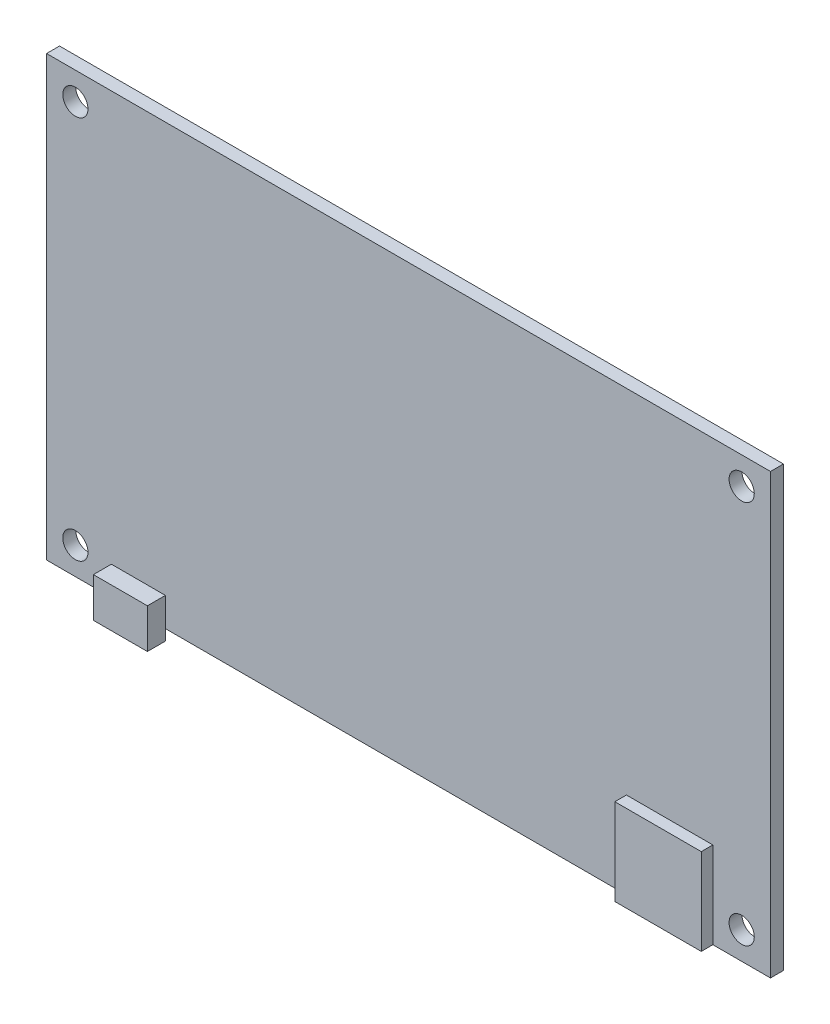
ISO-10303-21;
HEADER;
FILE_DESCRIPTION(('STEP AP214'),'2;1');
FILE_NAME('part.step','',(''),(''),'','','');
FILE_SCHEMA(('AUTOMOTIVE_DESIGN { 1 0 10303 214 1 1 1 1 }'));
ENDSEC;
DATA;
#1=APPLICATION_CONTEXT('core data for automotive mechanical design processes');
#2=APPLICATION_PROTOCOL_DEFINITION('international standard','automotive_design',2000,#1);
#3=PRODUCT_CONTEXT('',#1,'mechanical');
#4=PRODUCT('Part','Part','',(#3));
#5=PRODUCT_RELATED_PRODUCT_CATEGORY('part','',(#4));
#6=PRODUCT_DEFINITION_FORMATION('','',#4);
#7=PRODUCT_DEFINITION_CONTEXT('part definition',#1,'design');
#8=PRODUCT_DEFINITION('design','',#6,#7);
#9=PRODUCT_DEFINITION_SHAPE('','',#8);
#10=(LENGTH_UNIT() NAMED_UNIT(*) SI_UNIT(.MILLI.,.METRE.));
#11=(NAMED_UNIT(*) PLANE_ANGLE_UNIT() SI_UNIT($,.RADIAN.));
#12=(NAMED_UNIT(*) SI_UNIT($,.STERADIAN.) SOLID_ANGLE_UNIT());
#13=UNCERTAINTY_MEASURE_WITH_UNIT(LENGTH_MEASURE(1.E-05),#10,'distance_accuracy_value','');
#14=(GEOMETRIC_REPRESENTATION_CONTEXT(3) GLOBAL_UNCERTAINTY_ASSIGNED_CONTEXT((#13)) GLOBAL_UNIT_ASSIGNED_CONTEXT((#10,
#11,#12)) REPRESENTATION_CONTEXT('',''));
#15=CARTESIAN_POINT('',(0.,0.,0.));
#16=DIRECTION('',(0.,0.,1.));
#17=DIRECTION('',(1.,0.,0.));
#18=AXIS2_PLACEMENT_3D('',#15,#16,#17);
#19=CARTESIAN_POINT('',(-50.25,0.,1.8));
#20=DIRECTION('',(0.,0.,1.));
#21=DIRECTION('',(1.,0.,0.));
#22=AXIS2_PLACEMENT_3D('',#19,#20,#21);
#23=PLANE('',#22);
#24=CARTESIAN_POINT('',(46.25,57.1,1.8));
#25=DIRECTION('',(0.,0.,-1.));
#26=DIRECTION('',(1.,0.,0.));
#27=AXIS2_PLACEMENT_3D('',#24,#25,#26);
#28=CIRCLE('',#27,1.75);
#29=CARTESIAN_POINT('',(48.,57.1,1.8));
#30=VERTEX_POINT('',#29);
#31=EDGE_CURVE('E276',#30,#30,#28,.T.);
#32=ORIENTED_EDGE('',*,*,#31,.T.);
#33=EDGE_LOOP('',(#32));
#34=FACE_BOUND('',#33,.T.);
#35=CARTESIAN_POINT('',(-46.25,3.8,1.8));
#36=DIRECTION('',(0.,0.,1.));
#37=DIRECTION('',(1.,0.,0.));
#38=AXIS2_PLACEMENT_3D('',#35,#36,#37);
#39=CIRCLE('',#38,1.75);
#40=CARTESIAN_POINT('',(-44.5,3.8,1.8));
#41=VERTEX_POINT('',#40);
#42=EDGE_CURVE('E296',#41,#41,#39,.T.);
#43=ORIENTED_EDGE('',*,*,#42,.F.);
#44=EDGE_LOOP('',(#43));
#45=FACE_BOUND('',#44,.T.);
#46=CARTESIAN_POINT('',(-46.25,57.1,1.8));
#47=DIRECTION('',(0.,0.,1.));
#48=DIRECTION('',(-1.,0.,0.));
#49=AXIS2_PLACEMENT_3D('',#46,#47,#48);
#50=CIRCLE('',#49,1.75);
#51=CARTESIAN_POINT('',(-48.,57.1,1.8));
#52=VERTEX_POINT('',#51);
#53=EDGE_CURVE('E288',#52,#52,#50,.T.);
#54=ORIENTED_EDGE('',*,*,#53,.F.);
#55=EDGE_LOOP('',(#54));
#56=FACE_BOUND('',#55,.T.);
#57=CARTESIAN_POINT('',(46.25,3.8,1.8));
#58=DIRECTION('',(0.,0.,-1.));
#59=DIRECTION('',(-1.,0.,0.));
#60=AXIS2_PLACEMENT_3D('',#57,#58,#59);
#61=CIRCLE('',#60,1.75);
#62=CARTESIAN_POINT('',(44.5,3.8,1.8));
#63=VERTEX_POINT('',#62);
#64=EDGE_CURVE('E285',#63,#63,#61,.T.);
#65=ORIENTED_EDGE('',*,*,#64,.T.);
#66=EDGE_LOOP('',(#65));
#67=FACE_BOUND('',#66,.T.);
#68=DIRECTION('',(1.,0.,0.));
#69=VECTOR('',#68,1.);
#70=CARTESIAN_POINT('',(-50.25,0.,1.8));
#71=LINE('',#70,#69);
#72=CARTESIAN_POINT('',(-50.25,0.,1.8));
#73=VERTEX_POINT('',#72);
#74=CARTESIAN_POINT('',(-41.25,0.,1.8));
#75=VERTEX_POINT('',#74);
#76=EDGE_CURVE('E193',#73,#75,#71,.T.);
#77=ORIENTED_EDGE('',*,*,#76,.T.);
#78=DIRECTION('',(0.,-1.,0.));
#79=VECTOR('',#78,1.);
#80=CARTESIAN_POINT('',(-41.25,-1.5,1.8));
#81=LINE('',#80,#79);
#82=CARTESIAN_POINT('',(-41.25,4.,1.8));
#83=VERTEX_POINT('',#82);
#84=EDGE_CURVE('E60',#83,#75,#81,.T.);
#85=ORIENTED_EDGE('',*,*,#84,.F.);
#86=DIRECTION('',(-1.,0.,0.));
#87=VECTOR('',#86,1.);
#88=CARTESIAN_POINT('',(-41.25,4.,1.8));
#89=LINE('',#88,#87);
#90=CARTESIAN_POINT('',(-33.75,4.,1.8));
#91=VERTEX_POINT('',#90);
#92=EDGE_CURVE('E55',#91,#83,#89,.T.);
#93=ORIENTED_EDGE('',*,*,#92,.F.);
#94=DIRECTION('',(0.,1.,0.));
#95=VECTOR('',#94,1.);
#96=CARTESIAN_POINT('',(-33.75,-1.5,1.8));
#97=LINE('',#96,#95);
#98=CARTESIAN_POINT('',(-33.75,0.,1.8));
#99=VERTEX_POINT('',#98);
#100=EDGE_CURVE('E142',#99,#91,#97,.T.);
#101=ORIENTED_EDGE('',*,*,#100,.F.);
#102=CARTESIAN_POINT('',(30.25,0.,1.8));
#103=VERTEX_POINT('',#102);
#104=EDGE_CURVE('E41',#99,#103,#71,.T.);
#105=ORIENTED_EDGE('',*,*,#104,.T.);
#106=DIRECTION('',(0.,-1.,0.));
#107=VECTOR('',#106,1.);
#108=CARTESIAN_POINT('',(30.25,0.,1.8));
#109=LINE('',#108,#107);
#110=CARTESIAN_POINT('',(30.25,12.,1.8));
#111=VERTEX_POINT('',#110);
#112=EDGE_CURVE('E161',#111,#103,#109,.T.);
#113=ORIENTED_EDGE('',*,*,#112,.F.);
#114=DIRECTION('',(-1.,0.,0.));
#115=VECTOR('',#114,1.);
#116=CARTESIAN_POINT('',(30.25,12.,1.8));
#117=LINE('',#116,#115);
#118=CARTESIAN_POINT('',(42.25,12.,1.8));
#119=VERTEX_POINT('',#118);
#120=EDGE_CURVE('E176',#119,#111,#117,.T.);
#121=ORIENTED_EDGE('',*,*,#120,.F.);
#122=DIRECTION('',(0.,1.,0.));
#123=VECTOR('',#122,1.);
#124=CARTESIAN_POINT('',(42.25,0.,1.8));
#125=LINE('',#124,#123);
#126=CARTESIAN_POINT('',(42.25,0.,1.8));
#127=VERTEX_POINT('',#126);
#128=EDGE_CURVE('E263',#127,#119,#125,.T.);
#129=ORIENTED_EDGE('',*,*,#128,.F.);
#130=CARTESIAN_POINT('',(50.25,0.,1.8));
#131=VERTEX_POINT('',#130);
#132=EDGE_CURVE('E204',#127,#131,#71,.T.);
#133=ORIENTED_EDGE('',*,*,#132,.T.);
#134=DIRECTION('',(0.,1.,0.));
#135=VECTOR('',#134,1.);
#136=CARTESIAN_POINT('',(50.25,60.9,1.8));
#137=LINE('',#136,#135);
#138=CARTESIAN_POINT('',(50.25,60.9,1.8));
#139=VERTEX_POINT('',#138);
#140=EDGE_CURVE('E199',#131,#139,#137,.T.);
#141=ORIENTED_EDGE('',*,*,#140,.T.);
#142=DIRECTION('',(-1.,0.,0.));
#143=VECTOR('',#142,1.);
#144=CARTESIAN_POINT('',(-50.25,60.9,1.8));
#145=LINE('',#144,#143);
#146=CARTESIAN_POINT('',(-50.25,60.9,1.8));
#147=VERTEX_POINT('',#146);
#148=EDGE_CURVE('E217',#139,#147,#145,.T.);
#149=ORIENTED_EDGE('',*,*,#148,.T.);
#150=DIRECTION('',(0.,-1.,0.));
#151=VECTOR('',#150,1.);
#152=CARTESIAN_POINT('',(-50.25,60.9,1.8));
#153=LINE('',#152,#151);
#154=EDGE_CURVE('E197',#147,#73,#153,.T.);
#155=ORIENTED_EDGE('',*,*,#154,.T.);
#156=EDGE_LOOP('',(#77,#85,#93,#101,#105,#113,#121,#129,#133,#141,#149,#155));
#157=FACE_BOUND('',#156,.T.);
#158=ADVANCED_FACE('F37',(#34,#45,#56,#67,#157),#23,.T.);
#159=CARTESIAN_POINT('',(-50.25,0.,0.));
#160=DIRECTION('',(0.,0.,1.));
#161=DIRECTION('',(1.,0.,0.));
#162=AXIS2_PLACEMENT_3D('',#159,#160,#161);
#163=PLANE('',#162);
#164=CARTESIAN_POINT('',(46.25,3.8,0.));
#165=DIRECTION('',(0.,0.,1.));
#166=DIRECTION('',(1.,0.,0.));
#167=AXIS2_PLACEMENT_3D('',#164,#165,#166);
#168=CIRCLE('',#167,1.75);
#169=CARTESIAN_POINT('',(48.,3.8,0.));
#170=VERTEX_POINT('',#169);
#171=EDGE_CURVE('E283',#170,#170,#168,.T.);
#172=ORIENTED_EDGE('',*,*,#171,.T.);
#173=EDGE_LOOP('',(#172));
#174=FACE_BOUND('',#173,.T.);
#175=CARTESIAN_POINT('',(-46.25,57.1,0.));
#176=DIRECTION('',(0.,0.,1.));
#177=DIRECTION('',(1.,0.,0.));
#178=AXIS2_PLACEMENT_3D('',#175,#176,#177);
#179=CIRCLE('',#178,1.75);
#180=CARTESIAN_POINT('',(-44.5,57.1,0.));
#181=VERTEX_POINT('',#180);
#182=EDGE_CURVE('E293',#181,#181,#179,.F.);
#183=ORIENTED_EDGE('',*,*,#182,.F.);
#184=EDGE_LOOP('',(#183));
#185=FACE_BOUND('',#184,.T.);
#186=CARTESIAN_POINT('',(-46.25,3.8,0.));
#187=DIRECTION('',(0.,0.,1.));
#188=DIRECTION('',(1.,0.,0.));
#189=AXIS2_PLACEMENT_3D('',#186,#187,#188);
#190=CIRCLE('',#189,1.75);
#191=CARTESIAN_POINT('',(-44.5,3.8,0.));
#192=VERTEX_POINT('',#191);
#193=EDGE_CURVE('E226',#192,#192,#190,.F.);
#194=ORIENTED_EDGE('',*,*,#193,.F.);
#195=EDGE_LOOP('',(#194));
#196=FACE_BOUND('',#195,.T.);
#197=DIRECTION('',(0.,-1.,0.));
#198=VECTOR('',#197,1.);
#199=CARTESIAN_POINT('',(-50.25,60.9,0.));
#200=LINE('',#199,#198);
#201=CARTESIAN_POINT('',(-50.25,60.9,0.));
#202=VERTEX_POINT('',#201);
#203=CARTESIAN_POINT('',(-50.25,0.,0.));
#204=VERTEX_POINT('',#203);
#205=EDGE_CURVE('E224',#202,#204,#200,.T.);
#206=ORIENTED_EDGE('',*,*,#205,.F.);
#207=DIRECTION('',(-1.,0.,0.));
#208=VECTOR('',#207,1.);
#209=CARTESIAN_POINT('',(-50.25,60.9,0.));
#210=LINE('',#209,#208);
#211=CARTESIAN_POINT('',(50.25,60.9,0.));
#212=VERTEX_POINT('',#211);
#213=EDGE_CURVE('E218',#212,#202,#210,.T.);
#214=ORIENTED_EDGE('',*,*,#213,.F.);
#215=DIRECTION('',(0.,1.,0.));
#216=VECTOR('',#215,1.);
#217=CARTESIAN_POINT('',(50.25,60.9,0.));
#218=LINE('',#217,#216);
#219=CARTESIAN_POINT('',(50.25,0.,0.));
#220=VERTEX_POINT('',#219);
#221=EDGE_CURVE('E220',#220,#212,#218,.T.);
#222=ORIENTED_EDGE('',*,*,#221,.F.);
#223=DIRECTION('',(1.,0.,0.));
#224=VECTOR('',#223,1.);
#225=CARTESIAN_POINT('',(-50.25,0.,0.));
#226=LINE('',#225,#224);
#227=EDGE_CURVE('E222',#204,#220,#226,.T.);
#228=ORIENTED_EDGE('',*,*,#227,.F.);
#229=EDGE_LOOP('',(#206,#214,#222,#228));
#230=FACE_BOUND('',#229,.T.);
#231=CARTESIAN_POINT('',(46.25,57.1,0.));
#232=DIRECTION('',(0.,0.,1.));
#233=DIRECTION('',(1.,0.,0.));
#234=AXIS2_PLACEMENT_3D('',#231,#232,#233);
#235=CIRCLE('',#234,1.75);
#236=CARTESIAN_POINT('',(48.,57.1,0.));
#237=VERTEX_POINT('',#236);
#238=EDGE_CURVE('E274',#237,#237,#235,.T.);
#239=ORIENTED_EDGE('',*,*,#238,.T.);
#240=EDGE_LOOP('',(#239));
#241=FACE_BOUND('',#240,.T.);
#242=ADVANCED_FACE('F303',(#174,#185,#196,#230,#241),#163,.F.);
#243=CARTESIAN_POINT('',(-50.25,60.9,1.8));
#244=DIRECTION('',(1.,0.,0.));
#245=DIRECTION('',(0.,1.,0.));
#246=AXIS2_PLACEMENT_3D('',#243,#244,#245);
#247=PLANE('',#246);
#248=ORIENTED_EDGE('',*,*,#205,.T.);
#249=DIRECTION('',(0.,0.,-1.));
#250=VECTOR('',#249,1.);
#251=CARTESIAN_POINT('',(-50.25,0.,1.8));
#252=LINE('',#251,#250);
#253=EDGE_CURVE('E12',#73,#204,#252,.T.);
#254=ORIENTED_EDGE('',*,*,#253,.F.);
#255=ORIENTED_EDGE('',*,*,#154,.F.);
#256=DIRECTION('',(0.,0.,-1.));
#257=VECTOR('',#256,1.);
#258=CARTESIAN_POINT('',(-50.25,60.9,1.8));
#259=LINE('',#258,#257);
#260=EDGE_CURVE('E214',#147,#202,#259,.T.);
#261=ORIENTED_EDGE('',*,*,#260,.T.);
#262=EDGE_LOOP('',(#248,#254,#255,#261));
#263=FACE_BOUND('',#262,.T.);
#264=ADVANCED_FACE('F39',(#263),#247,.F.);
#265=CARTESIAN_POINT('',(-50.25,0.,1.8));
#266=DIRECTION('',(0.,1.,0.));
#267=DIRECTION('',(0.,0.,1.));
#268=AXIS2_PLACEMENT_3D('',#265,#266,#267);
#269=PLANE('',#268);
#270=ORIENTED_EDGE('',*,*,#227,.T.);
#271=DIRECTION('',(0.,0.,-1.));
#272=VECTOR('',#271,1.);
#273=CARTESIAN_POINT('',(50.25,0.,1.8));
#274=LINE('',#273,#272);
#275=EDGE_CURVE('E47',#131,#220,#274,.T.);
#276=ORIENTED_EDGE('',*,*,#275,.F.);
#277=ORIENTED_EDGE('',*,*,#132,.F.);
#278=DIRECTION('',(0.,0.,-1.));
#279=VECTOR('',#278,1.);
#280=CARTESIAN_POINT('',(42.25,0.,23.7905627484771));
#281=LINE('',#280,#279);
#282=CARTESIAN_POINT('',(42.25,0.,3.41));
#283=VERTEX_POINT('',#282);
#284=EDGE_CURVE('E254',#283,#127,#281,.T.);
#285=ORIENTED_EDGE('',*,*,#284,.F.);
#286=DIRECTION('',(1.,0.,0.));
#287=VECTOR('',#286,1.);
#288=CARTESIAN_POINT('',(30.25,0.,3.41));
#289=LINE('',#288,#287);
#290=CARTESIAN_POINT('',(30.25,0.,3.41));
#291=VERTEX_POINT('',#290);
#292=EDGE_CURVE('E250',#291,#283,#289,.T.);
#293=ORIENTED_EDGE('',*,*,#292,.F.);
#294=DIRECTION('',(0.,0.,-1.));
#295=VECTOR('',#294,1.);
#296=CARTESIAN_POINT('',(30.25,0.,23.7905627484771));
#297=LINE('',#296,#295);
#298=EDGE_CURVE('E188',#291,#103,#297,.T.);
#299=ORIENTED_EDGE('',*,*,#298,.T.);
#300=ORIENTED_EDGE('',*,*,#104,.F.);
#301=EDGE_CURVE('E191',#75,#99,#71,.T.);
#302=ORIENTED_EDGE('',*,*,#301,.F.);
#303=ORIENTED_EDGE('',*,*,#76,.F.);
#304=ORIENTED_EDGE('',*,*,#253,.T.);
#305=EDGE_LOOP('',(#270,#276,#277,#285,#293,#299,#300,#302,#303,#304));
#306=FACE_BOUND('',#305,.T.);
#307=ADVANCED_FACE('F247',(#306),#269,.F.);
#308=CARTESIAN_POINT('',(50.25,60.9,1.8));
#309=DIRECTION('',(-1.,0.,0.));
#310=DIRECTION('',(0.,0.,1.));
#311=AXIS2_PLACEMENT_3D('',#308,#309,#310);
#312=PLANE('',#311);
#313=ORIENTED_EDGE('',*,*,#221,.T.);
#314=DIRECTION('',(0.,0.,-1.));
#315=VECTOR('',#314,1.);
#316=CARTESIAN_POINT('',(50.25,60.9,1.8));
#317=LINE('',#316,#315);
#318=EDGE_CURVE('E211',#139,#212,#317,.T.);
#319=ORIENTED_EDGE('',*,*,#318,.F.);
#320=ORIENTED_EDGE('',*,*,#140,.F.);
#321=ORIENTED_EDGE('',*,*,#275,.T.);
#322=EDGE_LOOP('',(#313,#319,#320,#321));
#323=FACE_BOUND('',#322,.T.);
#324=ADVANCED_FACE('F235',(#323),#312,.F.);
#325=CARTESIAN_POINT('',(-50.25,60.9,1.8));
#326=DIRECTION('',(0.,-1.,0.));
#327=DIRECTION('',(0.,0.,-1.));
#328=AXIS2_PLACEMENT_3D('',#325,#326,#327);
#329=PLANE('',#328);
#330=ORIENTED_EDGE('',*,*,#213,.T.);
#331=ORIENTED_EDGE('',*,*,#260,.F.);
#332=ORIENTED_EDGE('',*,*,#148,.F.);
#333=ORIENTED_EDGE('',*,*,#318,.T.);
#334=EDGE_LOOP('',(#330,#331,#332,#333));
#335=FACE_BOUND('',#334,.T.);
#336=ADVANCED_FACE('F239',(#335),#329,.F.);
#337=CARTESIAN_POINT('',(-46.25,3.8,-0.000999999999999916));
#338=DIRECTION('',(0.,0.,1.));
#339=DIRECTION('',(1.,0.,0.));
#340=AXIS2_PLACEMENT_3D('',#337,#338,#339);
#341=CYLINDRICAL_SURFACE('',#340,1.75);
#342=ORIENTED_EDGE('',*,*,#42,.T.);
#343=EDGE_LOOP('',(#342));
#344=FACE_BOUND('',#343,.T.);
#345=ORIENTED_EDGE('',*,*,#193,.T.);
#346=EDGE_LOOP('',(#345));
#347=FACE_BOUND('',#346,.T.);
#348=ADVANCED_FACE('F301',(#344,#347),#341,.F.);
#349=CARTESIAN_POINT('',(-46.25,57.1,-0.000999999999999916));
#350=DIRECTION('',(0.,0.,1.));
#351=DIRECTION('',(1.,0.,0.));
#352=AXIS2_PLACEMENT_3D('',#349,#350,#351);
#353=CYLINDRICAL_SURFACE('',#352,1.75);
#354=ORIENTED_EDGE('',*,*,#53,.T.);
#355=EDGE_LOOP('',(#354));
#356=FACE_BOUND('',#355,.T.);
#357=ORIENTED_EDGE('',*,*,#182,.T.);
#358=EDGE_LOOP('',(#357));
#359=FACE_BOUND('',#358,.T.);
#360=ADVANCED_FACE('F321',(#356,#359),#353,.F.);
#361=CARTESIAN_POINT('',(46.25,3.8,-0.000999999999999916));
#362=DIRECTION('',(0.,0.,1.));
#363=DIRECTION('',(1.,0.,0.));
#364=AXIS2_PLACEMENT_3D('',#361,#362,#363);
#365=CYLINDRICAL_SURFACE('',#364,1.75);
#366=ORIENTED_EDGE('',*,*,#64,.F.);
#367=EDGE_LOOP('',(#366));
#368=FACE_BOUND('',#367,.T.);
#369=ORIENTED_EDGE('',*,*,#171,.F.);
#370=EDGE_LOOP('',(#369));
#371=FACE_BOUND('',#370,.T.);
#372=ADVANCED_FACE('F313',(#368,#371),#365,.F.);
#373=CARTESIAN_POINT('',(46.25,57.1,-0.000999999999999916));
#374=DIRECTION('',(0.,0.,1.));
#375=DIRECTION('',(1.,0.,0.));
#376=AXIS2_PLACEMENT_3D('',#373,#374,#375);
#377=CYLINDRICAL_SURFACE('',#376,1.75);
#378=ORIENTED_EDGE('',*,*,#31,.F.);
#379=EDGE_LOOP('',(#378));
#380=FACE_BOUND('',#379,.T.);
#381=ORIENTED_EDGE('',*,*,#238,.F.);
#382=EDGE_LOOP('',(#381));
#383=FACE_BOUND('',#382,.T.);
#384=ADVANCED_FACE('F311',(#380,#383),#377,.F.);
#385=CARTESIAN_POINT('',(30.25,0.,23.7905627484771));
#386=DIRECTION('',(1.,0.,0.));
#387=DIRECTION('',(0.,0.,-1.));
#388=AXIS2_PLACEMENT_3D('',#385,#386,#387);
#389=PLANE('',#388);
#390=DIRECTION('',(0.,-1.,0.));
#391=VECTOR('',#390,1.);
#392=CARTESIAN_POINT('',(30.25,0.,3.41));
#393=LINE('',#392,#391);
#394=CARTESIAN_POINT('',(30.25,12.,3.41));
#395=VERTEX_POINT('',#394);
#396=EDGE_CURVE('E256',#395,#291,#393,.T.);
#397=ORIENTED_EDGE('',*,*,#396,.F.);
#398=DIRECTION('',(0.,0.,-1.));
#399=VECTOR('',#398,1.);
#400=CARTESIAN_POINT('',(30.25,12.,23.7905627484771));
#401=LINE('',#400,#399);
#402=EDGE_CURVE('E158',#395,#111,#401,.T.);
#403=ORIENTED_EDGE('',*,*,#402,.T.);
#404=ORIENTED_EDGE('',*,*,#112,.T.);
#405=ORIENTED_EDGE('',*,*,#298,.F.);
#406=EDGE_LOOP('',(#397,#403,#404,#405));
#407=FACE_BOUND('',#406,.T.);
#408=ADVANCED_FACE('F255',(#407),#389,.F.);
#409=CARTESIAN_POINT('',(42.25,0.,23.7905627484771));
#410=DIRECTION('',(-1.,0.,0.));
#411=DIRECTION('',(0.,-1.,0.));
#412=AXIS2_PLACEMENT_3D('',#409,#410,#411);
#413=PLANE('',#412);
#414=DIRECTION('',(0.,1.,0.));
#415=VECTOR('',#414,1.);
#416=CARTESIAN_POINT('',(42.25,0.,3.41));
#417=LINE('',#416,#415);
#418=CARTESIAN_POINT('',(42.25,12.,3.41));
#419=VERTEX_POINT('',#418);
#420=EDGE_CURVE('E183',#283,#419,#417,.T.);
#421=ORIENTED_EDGE('',*,*,#420,.F.);
#422=ORIENTED_EDGE('',*,*,#284,.T.);
#423=ORIENTED_EDGE('',*,*,#128,.T.);
#424=DIRECTION('',(0.,0.,-1.));
#425=VECTOR('',#424,1.);
#426=CARTESIAN_POINT('',(42.25,12.,23.7905627484771));
#427=LINE('',#426,#425);
#428=EDGE_CURVE('E180',#419,#119,#427,.T.);
#429=ORIENTED_EDGE('',*,*,#428,.F.);
#430=EDGE_LOOP('',(#421,#422,#423,#429));
#431=FACE_BOUND('',#430,.T.);
#432=ADVANCED_FACE('F266',(#431),#413,.F.);
#433=CARTESIAN_POINT('',(30.25,12.,23.7905627484771));
#434=DIRECTION('',(0.,-1.,0.));
#435=DIRECTION('',(0.,0.,-1.));
#436=AXIS2_PLACEMENT_3D('',#433,#434,#435);
#437=PLANE('',#436);
#438=DIRECTION('',(-1.,0.,0.));
#439=VECTOR('',#438,1.);
#440=CARTESIAN_POINT('',(30.25,12.,3.41));
#441=LINE('',#440,#439);
#442=EDGE_CURVE('E179',#419,#395,#441,.T.);
#443=ORIENTED_EDGE('',*,*,#442,.F.);
#444=ORIENTED_EDGE('',*,*,#428,.T.);
#445=ORIENTED_EDGE('',*,*,#120,.T.);
#446=ORIENTED_EDGE('',*,*,#402,.F.);
#447=EDGE_LOOP('',(#443,#444,#445,#446));
#448=FACE_BOUND('',#447,.T.);
#449=ADVANCED_FACE('F261',(#448),#437,.F.);
#450=CARTESIAN_POINT('',(-50.25,0.,3.41));
#451=DIRECTION('',(0.,0.,1.));
#452=DIRECTION('',(1.,0.,0.));
#453=AXIS2_PLACEMENT_3D('',#450,#451,#452);
#454=PLANE('',#453);
#455=ORIENTED_EDGE('',*,*,#442,.T.);
#456=ORIENTED_EDGE('',*,*,#396,.T.);
#457=ORIENTED_EDGE('',*,*,#292,.T.);
#458=ORIENTED_EDGE('',*,*,#420,.T.);
#459=EDGE_LOOP('',(#455,#456,#457,#458));
#460=FACE_BOUND('',#459,.T.);
#461=ADVANCED_FACE('F391',(#460),#454,.T.);
#462=CARTESIAN_POINT('',(-41.25,4.,1.8));
#463=DIRECTION('',(0.,0.,-1.));
#464=DIRECTION('',(-1.,0.,0.));
#465=AXIS2_PLACEMENT_3D('',#462,#463,#464);
#466=PLANE('',#465);
#467=ORIENTED_EDGE('',*,*,#301,.T.);
#468=CARTESIAN_POINT('',(-33.75,-1.5,1.8));
#469=VERTEX_POINT('',#468);
#470=EDGE_CURVE('E144',#469,#99,#97,.T.);
#471=ORIENTED_EDGE('',*,*,#470,.F.);
#472=DIRECTION('',(1.,0.,0.));
#473=VECTOR('',#472,1.);
#474=CARTESIAN_POINT('',(-41.25,-1.5,1.8));
#475=LINE('',#474,#473);
#476=CARTESIAN_POINT('',(-41.25,-1.5,1.8));
#477=VERTEX_POINT('',#476);
#478=EDGE_CURVE('E171',#477,#469,#475,.T.);
#479=ORIENTED_EDGE('',*,*,#478,.F.);
#480=EDGE_CURVE('E175',#75,#477,#81,.T.);
#481=ORIENTED_EDGE('',*,*,#480,.F.);
#482=EDGE_LOOP('',(#467,#471,#479,#481));
#483=FACE_BOUND('',#482,.T.);
#484=ADVANCED_FACE('F399',(#483),#466,.T.);
#485=CARTESIAN_POINT('',(-41.25,-1.5,17.9005376188691));
#486=DIRECTION('',(1.,0.,0.));
#487=DIRECTION('',(0.,0.,-1.));
#488=AXIS2_PLACEMENT_3D('',#485,#486,#487);
#489=PLANE('',#488);
#490=DIRECTION('',(0.,-1.,0.));
#491=VECTOR('',#490,1.);
#492=CARTESIAN_POINT('',(-41.25,-1.5,4.3));
#493=LINE('',#492,#491);
#494=CARTESIAN_POINT('',(-41.25,4.,4.3));
#495=VERTEX_POINT('',#494);
#496=CARTESIAN_POINT('',(-41.25,-1.5,4.3));
#497=VERTEX_POINT('',#496);
#498=EDGE_CURVE('E153',#495,#497,#493,.T.);
#499=ORIENTED_EDGE('',*,*,#498,.F.);
#500=DIRECTION('',(0.,0.,-1.));
#501=VECTOR('',#500,1.);
#502=CARTESIAN_POINT('',(-41.25,4.,17.9005376188691));
#503=LINE('',#502,#501);
#504=EDGE_CURVE('E149',#495,#83,#503,.T.);
#505=ORIENTED_EDGE('',*,*,#504,.T.);
#506=ORIENTED_EDGE('',*,*,#84,.T.);
#507=ORIENTED_EDGE('',*,*,#480,.T.);
#508=DIRECTION('',(0.,0.,-1.));
#509=VECTOR('',#508,1.);
#510=CARTESIAN_POINT('',(-41.25,-1.5,17.9005376188691));
#511=LINE('',#510,#509);
#512=EDGE_CURVE('E168',#497,#477,#511,.T.);
#513=ORIENTED_EDGE('',*,*,#512,.F.);
#514=EDGE_LOOP('',(#499,#505,#506,#507,#513));
#515=FACE_BOUND('',#514,.T.);
#516=ADVANCED_FACE('F416',(#515),#489,.F.);
#517=CARTESIAN_POINT('',(-41.25,-1.5,17.9005376188691));
#518=DIRECTION('',(0.,1.,0.));
#519=DIRECTION('',(0.,0.,1.));
#520=AXIS2_PLACEMENT_3D('',#517,#518,#519);
#521=PLANE('',#520);
#522=DIRECTION('',(1.,0.,0.));
#523=VECTOR('',#522,1.);
#524=CARTESIAN_POINT('',(-41.25,-1.5,4.3));
#525=LINE('',#524,#523);
#526=CARTESIAN_POINT('',(-33.75,-1.5,4.3));
#527=VERTEX_POINT('',#526);
#528=EDGE_CURVE('E157',#497,#527,#525,.T.);
#529=ORIENTED_EDGE('',*,*,#528,.F.);
#530=ORIENTED_EDGE('',*,*,#512,.T.);
#531=ORIENTED_EDGE('',*,*,#478,.T.);
#532=DIRECTION('',(0.,0.,-1.));
#533=VECTOR('',#532,1.);
#534=CARTESIAN_POINT('',(-33.75,-1.5,17.9005376188691));
#535=LINE('',#534,#533);
#536=EDGE_CURVE('E172',#527,#469,#535,.T.);
#537=ORIENTED_EDGE('',*,*,#536,.F.);
#538=EDGE_LOOP('',(#529,#530,#531,#537));
#539=FACE_BOUND('',#538,.T.);
#540=ADVANCED_FACE('F426',(#539),#521,.F.);
#541=CARTESIAN_POINT('',(-33.75,-1.5,17.9005376188691));
#542=DIRECTION('',(-1.,0.,0.));
#543=DIRECTION('',(0.,0.,1.));
#544=AXIS2_PLACEMENT_3D('',#541,#542,#543);
#545=PLANE('',#544);
#546=DIRECTION('',(0.,1.,0.));
#547=VECTOR('',#546,1.);
#548=CARTESIAN_POINT('',(-33.75,-1.5,4.3));
#549=LINE('',#548,#547);
#550=CARTESIAN_POINT('',(-33.75,4.,4.3));
#551=VERTEX_POINT('',#550);
#552=EDGE_CURVE('E139',#527,#551,#549,.T.);
#553=ORIENTED_EDGE('',*,*,#552,.F.);
#554=ORIENTED_EDGE('',*,*,#536,.T.);
#555=ORIENTED_EDGE('',*,*,#470,.T.);
#556=ORIENTED_EDGE('',*,*,#100,.T.);
#557=DIRECTION('',(0.,0.,-1.));
#558=VECTOR('',#557,1.);
#559=CARTESIAN_POINT('',(-33.75,4.,17.9005376188691));
#560=LINE('',#559,#558);
#561=EDGE_CURVE('E135',#551,#91,#560,.T.);
#562=ORIENTED_EDGE('',*,*,#561,.F.);
#563=EDGE_LOOP('',(#553,#554,#555,#556,#562));
#564=FACE_BOUND('',#563,.T.);
#565=ADVANCED_FACE('F137',(#564),#545,.F.);
#566=CARTESIAN_POINT('',(-41.25,4.,17.9005376188691));
#567=DIRECTION('',(0.,-1.,0.));
#568=DIRECTION('',(0.,0.,-1.));
#569=AXIS2_PLACEMENT_3D('',#566,#567,#568);
#570=PLANE('',#569);
#571=DIRECTION('',(-1.,0.,0.));
#572=VECTOR('',#571,1.);
#573=CARTESIAN_POINT('',(-41.25,4.,4.3));
#574=LINE('',#573,#572);
#575=EDGE_CURVE('E147',#551,#495,#574,.T.);
#576=ORIENTED_EDGE('',*,*,#575,.F.);
#577=ORIENTED_EDGE('',*,*,#561,.T.);
#578=ORIENTED_EDGE('',*,*,#92,.T.);
#579=ORIENTED_EDGE('',*,*,#504,.F.);
#580=EDGE_LOOP('',(#576,#577,#578,#579));
#581=FACE_BOUND('',#580,.T.);
#582=ADVANCED_FACE('F148',(#581),#570,.F.);
#583=CARTESIAN_POINT('',(-50.25,0.,4.3));
#584=DIRECTION('',(0.,0.,1.));
#585=DIRECTION('',(1.,0.,0.));
#586=AXIS2_PLACEMENT_3D('',#583,#584,#585);
#587=PLANE('',#586);
#588=ORIENTED_EDGE('',*,*,#575,.T.);
#589=ORIENTED_EDGE('',*,*,#498,.T.);
#590=ORIENTED_EDGE('',*,*,#528,.T.);
#591=ORIENTED_EDGE('',*,*,#552,.T.);
#592=EDGE_LOOP('',(#588,#589,#590,#591));
#593=FACE_BOUND('',#592,.T.);
#594=ADVANCED_FACE('F156',(#593),#587,.T.);
#595=CLOSED_SHELL('',(#158,#242,#264,#307,#324,#336,#348,#360,#372,#384,#408,#432,#449,#461,
#484,#516,#540,#565,#582,#594));
#596=MANIFOLD_SOLID_BREP('B2',#595);
#597=ADVANCED_BREP_SHAPE_REPRESENTATION('',(#18,#596),#14);
#598=SHAPE_DEFINITION_REPRESENTATION(#9,#597);
ENDSEC;
END-ISO-10303-21;
